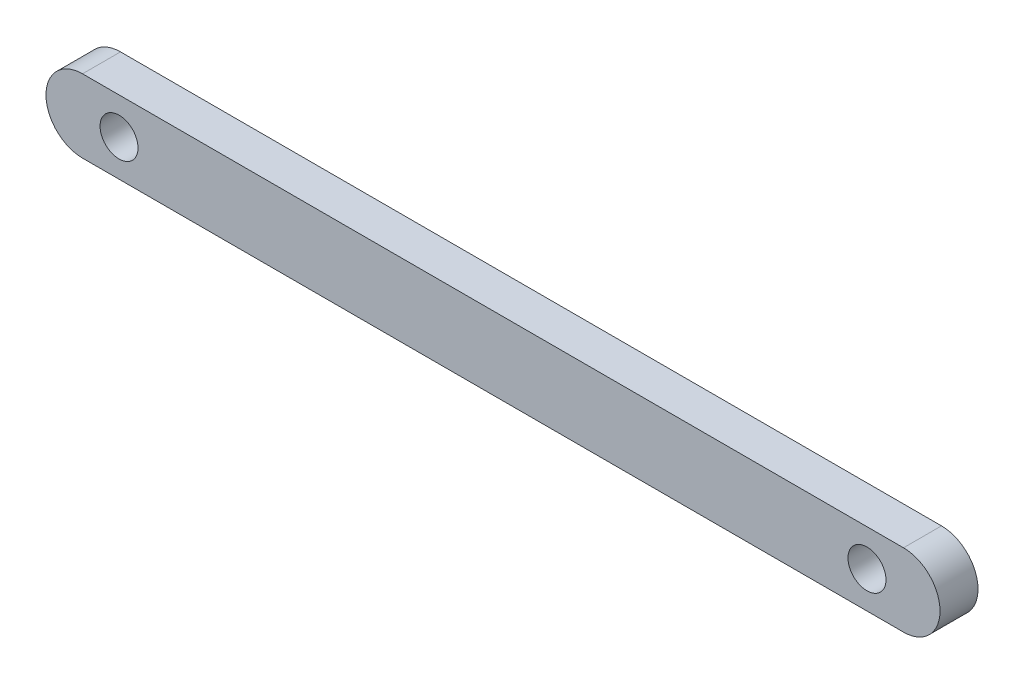
ISO-10303-21;
HEADER;
FILE_DESCRIPTION(('STEP AP214'),'2;1');
FILE_NAME('part.step','',(''),(''),'','','');
FILE_SCHEMA(('AUTOMOTIVE_DESIGN { 1 0 10303 214 1 1 1 1 }'));
ENDSEC;
DATA;
#1=APPLICATION_CONTEXT('core data for automotive mechanical design processes');
#2=APPLICATION_PROTOCOL_DEFINITION('international standard','automotive_design',2000,#1);
#3=PRODUCT_CONTEXT('',#1,'mechanical');
#4=PRODUCT('Part','Part','',(#3));
#5=PRODUCT_RELATED_PRODUCT_CATEGORY('part','',(#4));
#6=PRODUCT_DEFINITION_FORMATION('','',#4);
#7=PRODUCT_DEFINITION_CONTEXT('part definition',#1,'design');
#8=PRODUCT_DEFINITION('design','',#6,#7);
#9=PRODUCT_DEFINITION_SHAPE('','',#8);
#10=(LENGTH_UNIT() NAMED_UNIT(*) SI_UNIT(.MILLI.,.METRE.));
#11=(NAMED_UNIT(*) PLANE_ANGLE_UNIT() SI_UNIT($,.RADIAN.));
#12=(NAMED_UNIT(*) SI_UNIT($,.STERADIAN.) SOLID_ANGLE_UNIT());
#13=UNCERTAINTY_MEASURE_WITH_UNIT(LENGTH_MEASURE(1.E-05),#10,'distance_accuracy_value','');
#14=(GEOMETRIC_REPRESENTATION_CONTEXT(3) GLOBAL_UNCERTAINTY_ASSIGNED_CONTEXT((#13)) GLOBAL_UNIT_ASSIGNED_CONTEXT((#10,
#11,#12)) REPRESENTATION_CONTEXT('',''));
#15=CARTESIAN_POINT('',(0.,0.,0.));
#16=DIRECTION('',(0.,0.,1.));
#17=DIRECTION('',(1.,0.,0.));
#18=AXIS2_PLACEMENT_3D('',#15,#16,#17);
#19=CARTESIAN_POINT('',(0.,0.,3.302));
#20=DIRECTION('',(0.,0.,1.));
#21=DIRECTION('',(1.,0.,0.));
#22=AXIS2_PLACEMENT_3D('',#19,#20,#21);
#23=PLANE('',#22);
#24=CARTESIAN_POINT('',(3.175,0.,3.302));
#25=DIRECTION('',(0.,0.,1.));
#26=DIRECTION('',(1.,0.,0.));
#27=AXIS2_PLACEMENT_3D('',#24,#25,#26);
#28=CIRCLE('',#27,1.651);
#29=CARTESIAN_POINT('',(4.826,0.,3.302));
#30=VERTEX_POINT('',#29);
#31=EDGE_CURVE('E112',#30,#30,#28,.T.);
#32=ORIENTED_EDGE('',*,*,#31,.F.);
#33=EDGE_LOOP('',(#32));
#34=FACE_BOUND('',#33,.T.);
#35=CARTESIAN_POINT('',(0.,0.,3.302));
#36=DIRECTION('',(0.,0.,1.));
#37=DIRECTION('',(1.,0.,0.));
#38=AXIS2_PLACEMENT_3D('',#35,#36,#37);
#39=CIRCLE('',#38,3.175);
#40=CARTESIAN_POINT('',(0.,3.175,3.302));
#41=VERTEX_POINT('',#40);
#42=CARTESIAN_POINT('',(0.,-3.175,3.302));
#43=VERTEX_POINT('',#42);
#44=EDGE_CURVE('E92',#41,#43,#39,.T.);
#45=ORIENTED_EDGE('',*,*,#44,.T.);
#46=DIRECTION('',(1.,0.,0.));
#47=VECTOR('',#46,1.);
#48=CARTESIAN_POINT('',(0.,-3.175,3.302));
#49=LINE('',#48,#47);
#50=CARTESIAN_POINT('',(71.374,-3.175,3.302));
#51=VERTEX_POINT('',#50);
#52=EDGE_CURVE('E87',#43,#51,#49,.T.);
#53=ORIENTED_EDGE('',*,*,#52,.T.);
#54=CARTESIAN_POINT('',(71.374,0.,3.302));
#55=DIRECTION('',(0.,0.,1.));
#56=DIRECTION('',(1.,0.,0.));
#57=AXIS2_PLACEMENT_3D('',#54,#55,#56);
#58=CIRCLE('',#57,3.175);
#59=CARTESIAN_POINT('',(71.374,3.175,3.302));
#60=VERTEX_POINT('',#59);
#61=EDGE_CURVE('E90',#51,#60,#58,.T.);
#62=ORIENTED_EDGE('',*,*,#61,.T.);
#63=DIRECTION('',(-1.,0.,0.));
#64=VECTOR('',#63,1.);
#65=CARTESIAN_POINT('',(0.,3.175,3.302));
#66=LINE('',#65,#64);
#67=EDGE_CURVE('E57',#60,#41,#66,.T.);
#68=ORIENTED_EDGE('',*,*,#67,.T.);
#69=EDGE_LOOP('',(#45,#53,#62,#68));
#70=FACE_BOUND('',#69,.T.);
#71=CARTESIAN_POINT('',(68.199,0.,3.302));
#72=DIRECTION('',(0.,0.,1.));
#73=DIRECTION('',(1.,0.,0.));
#74=AXIS2_PLACEMENT_3D('',#71,#72,#73);
#75=CIRCLE('',#74,1.65100000000001);
#76=CARTESIAN_POINT('',(69.85,0.,3.302));
#77=VERTEX_POINT('',#76);
#78=EDGE_CURVE('E134',#77,#77,#75,.T.);
#79=ORIENTED_EDGE('',*,*,#78,.F.);
#80=EDGE_LOOP('',(#79));
#81=FACE_BOUND('',#80,.T.);
#82=ADVANCED_FACE('F39',(#34,#70,#81),#23,.T.);
#83=CARTESIAN_POINT('',(0.,0.,0.));
#84=DIRECTION('',(0.,0.,1.));
#85=DIRECTION('',(1.,0.,0.));
#86=AXIS2_PLACEMENT_3D('',#83,#84,#85);
#87=PLANE('',#86);
#88=CARTESIAN_POINT('',(0.,0.,0.));
#89=DIRECTION('',(0.,0.,1.));
#90=DIRECTION('',(1.,0.,0.));
#91=AXIS2_PLACEMENT_3D('',#88,#89,#90);
#92=CIRCLE('',#91,3.175);
#93=CARTESIAN_POINT('',(0.,3.175,0.));
#94=VERTEX_POINT('',#93);
#95=CARTESIAN_POINT('',(0.,-3.175,0.));
#96=VERTEX_POINT('',#95);
#97=EDGE_CURVE('E108',#94,#96,#92,.T.);
#98=ORIENTED_EDGE('',*,*,#97,.F.);
#99=DIRECTION('',(-1.,0.,0.));
#100=VECTOR('',#99,1.);
#101=CARTESIAN_POINT('',(0.,3.175,0.));
#102=LINE('',#101,#100);
#103=CARTESIAN_POINT('',(71.374,3.175,0.));
#104=VERTEX_POINT('',#103);
#105=EDGE_CURVE('E80',#104,#94,#102,.T.);
#106=ORIENTED_EDGE('',*,*,#105,.F.);
#107=CARTESIAN_POINT('',(71.374,0.,0.));
#108=DIRECTION('',(0.,0.,1.));
#109=DIRECTION('',(1.,0.,0.));
#110=AXIS2_PLACEMENT_3D('',#107,#108,#109);
#111=CIRCLE('',#110,3.175);
#112=CARTESIAN_POINT('',(71.374,-3.175,0.));
#113=VERTEX_POINT('',#112);
#114=EDGE_CURVE('E74',#113,#104,#111,.T.);
#115=ORIENTED_EDGE('',*,*,#114,.F.);
#116=DIRECTION('',(1.,0.,0.));
#117=VECTOR('',#116,1.);
#118=CARTESIAN_POINT('',(0.,-3.175,0.));
#119=LINE('',#118,#117);
#120=EDGE_CURVE('E97',#96,#113,#119,.T.);
#121=ORIENTED_EDGE('',*,*,#120,.F.);
#122=EDGE_LOOP('',(#98,#106,#115,#121));
#123=FACE_BOUND('',#122,.T.);
#124=CARTESIAN_POINT('',(3.175,0.,0.));
#125=DIRECTION('',(0.,0.,1.));
#126=DIRECTION('',(1.,0.,0.));
#127=AXIS2_PLACEMENT_3D('',#124,#125,#126);
#128=CIRCLE('',#127,1.651);
#129=CARTESIAN_POINT('',(4.826,0.,0.));
#130=VERTEX_POINT('',#129);
#131=EDGE_CURVE('E130',#130,#130,#128,.T.);
#132=ORIENTED_EDGE('',*,*,#131,.T.);
#133=EDGE_LOOP('',(#132));
#134=FACE_BOUND('',#133,.T.);
#135=CARTESIAN_POINT('',(68.199,0.,0.));
#136=DIRECTION('',(0.,0.,1.));
#137=DIRECTION('',(1.,0.,0.));
#138=AXIS2_PLACEMENT_3D('',#135,#136,#137);
#139=CIRCLE('',#138,1.65100000000001);
#140=CARTESIAN_POINT('',(69.85,0.,0.));
#141=VERTEX_POINT('',#140);
#142=EDGE_CURVE('E138',#141,#141,#139,.T.);
#143=ORIENTED_EDGE('',*,*,#142,.T.);
#144=EDGE_LOOP('',(#143));
#145=FACE_BOUND('',#144,.T.);
#146=ADVANCED_FACE('F125',(#123,#134,#145),#87,.F.);
#147=CARTESIAN_POINT('',(0.,0.,3.302));
#148=DIRECTION('',(0.,0.,-1.));
#149=DIRECTION('',(-1.,0.,0.));
#150=AXIS2_PLACEMENT_3D('',#147,#148,#149);
#151=CYLINDRICAL_SURFACE('',#150,3.175);
#152=ORIENTED_EDGE('',*,*,#97,.T.);
#153=DIRECTION('',(0.,0.,-1.));
#154=VECTOR('',#153,1.);
#155=CARTESIAN_POINT('',(0.,-3.175,3.302));
#156=LINE('',#155,#154);
#157=EDGE_CURVE('E11',#43,#96,#156,.T.);
#158=ORIENTED_EDGE('',*,*,#157,.F.);
#159=ORIENTED_EDGE('',*,*,#44,.F.);
#160=DIRECTION('',(0.,0.,-1.));
#161=VECTOR('',#160,1.);
#162=CARTESIAN_POINT('',(0.,3.175,3.302));
#163=LINE('',#162,#161);
#164=EDGE_CURVE('E104',#41,#94,#163,.T.);
#165=ORIENTED_EDGE('',*,*,#164,.T.);
#166=EDGE_LOOP('',(#152,#158,#159,#165));
#167=FACE_BOUND('',#166,.T.);
#168=ADVANCED_FACE('F41',(#167),#151,.T.);
#169=CARTESIAN_POINT('',(0.,-3.175,3.302));
#170=DIRECTION('',(0.,1.,0.));
#171=DIRECTION('',(0.,0.,1.));
#172=AXIS2_PLACEMENT_3D('',#169,#170,#171);
#173=PLANE('',#172);
#174=ORIENTED_EDGE('',*,*,#120,.T.);
#175=DIRECTION('',(0.,0.,-1.));
#176=VECTOR('',#175,1.);
#177=CARTESIAN_POINT('',(71.374,-3.175,3.302));
#178=LINE('',#177,#176);
#179=EDGE_CURVE('E49',#51,#113,#178,.T.);
#180=ORIENTED_EDGE('',*,*,#179,.F.);
#181=ORIENTED_EDGE('',*,*,#52,.F.);
#182=ORIENTED_EDGE('',*,*,#157,.T.);
#183=EDGE_LOOP('',(#174,#180,#181,#182));
#184=FACE_BOUND('',#183,.T.);
#185=ADVANCED_FACE('F96',(#184),#173,.F.);
#186=CARTESIAN_POINT('',(71.374,0.,3.302));
#187=DIRECTION('',(0.,0.,-1.));
#188=DIRECTION('',(-1.,0.,0.));
#189=AXIS2_PLACEMENT_3D('',#186,#187,#188);
#190=CYLINDRICAL_SURFACE('',#189,3.175);
#191=ORIENTED_EDGE('',*,*,#114,.T.);
#192=DIRECTION('',(0.,0.,-1.));
#193=VECTOR('',#192,1.);
#194=CARTESIAN_POINT('',(71.374,3.175,3.302));
#195=LINE('',#194,#193);
#196=EDGE_CURVE('E99',#60,#104,#195,.T.);
#197=ORIENTED_EDGE('',*,*,#196,.F.);
#198=ORIENTED_EDGE('',*,*,#61,.F.);
#199=ORIENTED_EDGE('',*,*,#179,.T.);
#200=EDGE_LOOP('',(#191,#197,#198,#199));
#201=FACE_BOUND('',#200,.T.);
#202=ADVANCED_FACE('F100',(#201),#190,.T.);
#203=CARTESIAN_POINT('',(0.,3.175,3.302));
#204=DIRECTION('',(0.,-1.,0.));
#205=DIRECTION('',(0.,0.,-1.));
#206=AXIS2_PLACEMENT_3D('',#203,#204,#205);
#207=PLANE('',#206);
#208=ORIENTED_EDGE('',*,*,#105,.T.);
#209=ORIENTED_EDGE('',*,*,#164,.F.);
#210=ORIENTED_EDGE('',*,*,#67,.F.);
#211=ORIENTED_EDGE('',*,*,#196,.T.);
#212=EDGE_LOOP('',(#208,#209,#210,#211));
#213=FACE_BOUND('',#212,.T.);
#214=ADVANCED_FACE('F122',(#213),#207,.F.);
#215=CARTESIAN_POINT('',(3.175,0.,3.302));
#216=DIRECTION('',(0.,0.,-1.));
#217=DIRECTION('',(-1.,0.,0.));
#218=AXIS2_PLACEMENT_3D('',#215,#216,#217);
#219=CYLINDRICAL_SURFACE('',#218,1.651);
#220=ORIENTED_EDGE('',*,*,#31,.T.);
#221=EDGE_LOOP('',(#220));
#222=FACE_BOUND('',#221,.T.);
#223=ORIENTED_EDGE('',*,*,#131,.F.);
#224=EDGE_LOOP('',(#223));
#225=FACE_BOUND('',#224,.T.);
#226=ADVANCED_FACE('F157',(#222,#225),#219,.F.);
#227=CARTESIAN_POINT('',(68.199,0.,3.302));
#228=DIRECTION('',(0.,0.,-1.));
#229=DIRECTION('',(-1.,0.,0.));
#230=AXIS2_PLACEMENT_3D('',#227,#228,#229);
#231=CYLINDRICAL_SURFACE('',#230,1.65100000000001);
#232=ORIENTED_EDGE('',*,*,#78,.T.);
#233=EDGE_LOOP('',(#232));
#234=FACE_BOUND('',#233,.T.);
#235=ORIENTED_EDGE('',*,*,#142,.F.);
#236=EDGE_LOOP('',(#235));
#237=FACE_BOUND('',#236,.T.);
#238=ADVANCED_FACE('F146',(#234,#237),#231,.F.);
#239=CLOSED_SHELL('',(#82,#146,#168,#185,#202,#214,#226,#238));
#240=MANIFOLD_SOLID_BREP('B2',#239);
#241=ADVANCED_BREP_SHAPE_REPRESENTATION('',(#18,#240),#14);
#242=SHAPE_DEFINITION_REPRESENTATION(#9,#241);
ENDSEC;
END-ISO-10303-21;
